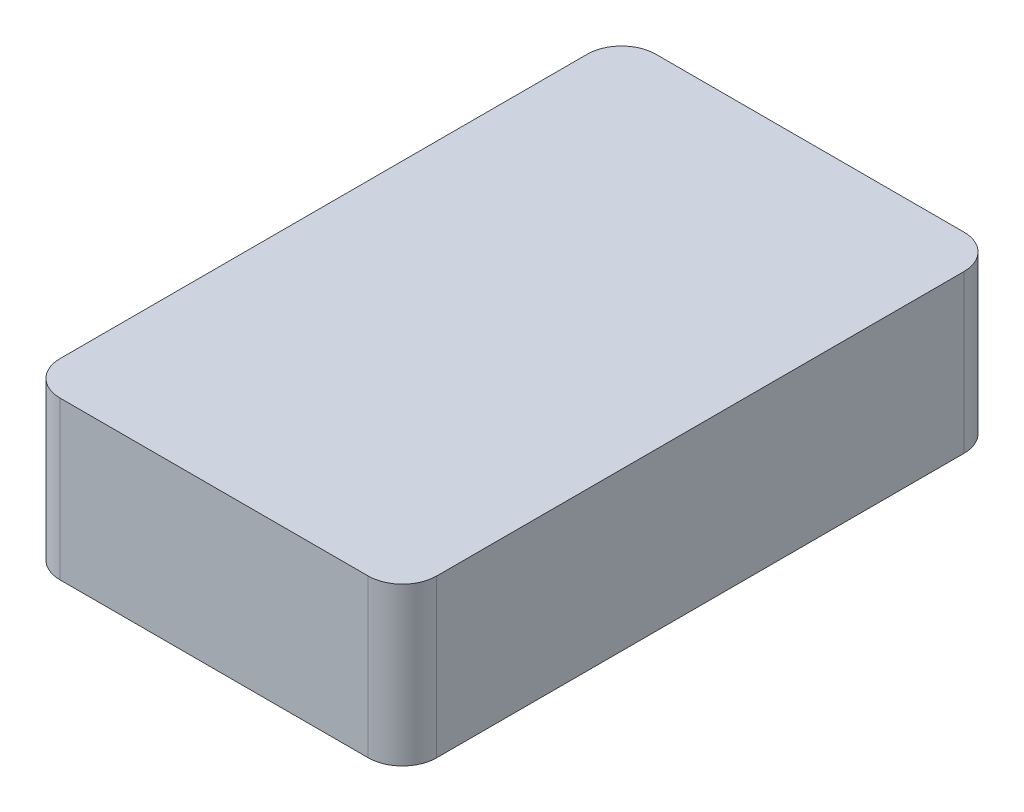
ISO-10303-21;
HEADER;
FILE_DESCRIPTION(('STEP AP214'),'2;1');
FILE_NAME('part.step','',(''),(''),'','','');
FILE_SCHEMA(('AUTOMOTIVE_DESIGN { 1 0 10303 214 1 1 1 1 }'));
ENDSEC;
DATA;
#1=APPLICATION_CONTEXT('core data for automotive mechanical design processes');
#2=APPLICATION_PROTOCOL_DEFINITION('international standard','automotive_design',2000,#1);
#3=PRODUCT_CONTEXT('',#1,'mechanical');
#4=PRODUCT('Part','Part','',(#3));
#5=PRODUCT_RELATED_PRODUCT_CATEGORY('part','',(#4));
#6=PRODUCT_DEFINITION_FORMATION('','',#4);
#7=PRODUCT_DEFINITION_CONTEXT('part definition',#1,'design');
#8=PRODUCT_DEFINITION('design','',#6,#7);
#9=PRODUCT_DEFINITION_SHAPE('','',#8);
#10=(LENGTH_UNIT() NAMED_UNIT(*) SI_UNIT(.MILLI.,.METRE.));
#11=(NAMED_UNIT(*) PLANE_ANGLE_UNIT() SI_UNIT($,.RADIAN.));
#12=(NAMED_UNIT(*) SI_UNIT($,.STERADIAN.) SOLID_ANGLE_UNIT());
#13=UNCERTAINTY_MEASURE_WITH_UNIT(LENGTH_MEASURE(1.E-05),#10,'distance_accuracy_value','');
#14=(GEOMETRIC_REPRESENTATION_CONTEXT(3) GLOBAL_UNCERTAINTY_ASSIGNED_CONTEXT((#13)) GLOBAL_UNIT_ASSIGNED_CONTEXT((#10,
#11,#12)) REPRESENTATION_CONTEXT('',''));
#15=CARTESIAN_POINT('',(0.,0.,0.));
#16=DIRECTION('',(0.,0.,1.));
#17=DIRECTION('',(1.,0.,0.));
#18=AXIS2_PLACEMENT_3D('',#15,#16,#17);
#19=CARTESIAN_POINT('',(-34.9399313153594,23.,20.7841209187291));
#20=DIRECTION('',(0.,-1.,0.));
#21=DIRECTION('',(0.,0.,-1.));
#22=AXIS2_PLACEMENT_3D('',#19,#20,#21);
#23=CYLINDRICAL_SURFACE('',#22,5.);
#24=CARTESIAN_POINT('',(-34.9399313153594,0.,20.7841209187291));
#25=DIRECTION('',(0.,1.,0.));
#26=DIRECTION('',(0.,0.,1.));
#27=AXIS2_PLACEMENT_3D('',#24,#25,#26);
#28=CIRCLE('',#27,5.);
#29=CARTESIAN_POINT('',(-39.9399313153594,0.,20.784120918729));
#30=VERTEX_POINT('',#29);
#31=CARTESIAN_POINT('',(-34.9399313153594,0.,25.7841209187291));
#32=VERTEX_POINT('',#31);
#33=EDGE_CURVE('E130',#30,#32,#28,.T.);
#34=ORIENTED_EDGE('',*,*,#33,.T.);
#35=DIRECTION('',(0.,-1.,0.));
#36=VECTOR('',#35,1.);
#37=CARTESIAN_POINT('',(-34.9399313153594,23.,25.7841209187291));
#38=LINE('',#37,#36);
#39=CARTESIAN_POINT('',(-34.9399313153594,23.,25.7841209187291));
#40=VERTEX_POINT('',#39);
#41=EDGE_CURVE('E11',#40,#32,#38,.T.);
#42=ORIENTED_EDGE('',*,*,#41,.F.);
#43=CARTESIAN_POINT('',(-34.9399313153594,23.,20.7841209187291));
#44=DIRECTION('',(0.,1.,0.));
#45=DIRECTION('',(0.,0.,1.));
#46=AXIS2_PLACEMENT_3D('',#43,#44,#45);
#47=CIRCLE('',#46,5.);
#48=CARTESIAN_POINT('',(-39.9399313153594,23.,20.784120918729));
#49=VERTEX_POINT('',#48);
#50=EDGE_CURVE('E144',#49,#40,#47,.T.);
#51=ORIENTED_EDGE('',*,*,#50,.F.);
#52=DIRECTION('',(0.,-1.,0.));
#53=VECTOR('',#52,1.);
#54=CARTESIAN_POINT('',(-39.9399313153594,23.,20.784120918729));
#55=LINE('',#54,#53);
#56=EDGE_CURVE('E126',#49,#30,#55,.T.);
#57=ORIENTED_EDGE('',*,*,#56,.T.);
#58=EDGE_LOOP('',(#34,#42,#51,#57));
#59=FACE_BOUND('',#58,.T.);
#60=ADVANCED_FACE('F34',(#59),#23,.T.);
#61=CARTESIAN_POINT('',(-34.9399313153594,23.,25.7841209187291));
#62=DIRECTION('',(0.,0.,-1.));
#63=DIRECTION('',(-1.,0.,0.));
#64=AXIS2_PLACEMENT_3D('',#61,#62,#63);
#65=PLANE('',#64);
#66=DIRECTION('',(1.,0.,0.));
#67=VECTOR('',#66,1.);
#68=CARTESIAN_POINT('',(-34.9399313153594,0.,25.7841209187291));
#69=LINE('',#68,#67);
#70=CARTESIAN_POINT('',(10.0600686846405,0.,25.7841209187291));
#71=VERTEX_POINT('',#70);
#72=EDGE_CURVE('E133',#32,#71,#69,.T.);
#73=ORIENTED_EDGE('',*,*,#72,.T.);
#74=DIRECTION('',(0.,-1.,0.));
#75=VECTOR('',#74,1.);
#76=CARTESIAN_POINT('',(10.0600686846405,23.,25.7841209187291));
#77=LINE('',#76,#75);
#78=CARTESIAN_POINT('',(10.0600686846405,23.,25.7841209187291));
#79=VERTEX_POINT('',#78);
#80=EDGE_CURVE('E42',#79,#71,#77,.T.);
#81=ORIENTED_EDGE('',*,*,#80,.F.);
#82=DIRECTION('',(1.,0.,0.));
#83=VECTOR('',#82,1.);
#84=CARTESIAN_POINT('',(-34.9399313153594,23.,25.7841209187291));
#85=LINE('',#84,#83);
#86=EDGE_CURVE('E93',#40,#79,#85,.T.);
#87=ORIENTED_EDGE('',*,*,#86,.F.);
#88=ORIENTED_EDGE('',*,*,#41,.T.);
#89=EDGE_LOOP('',(#73,#81,#87,#88));
#90=FACE_BOUND('',#89,.T.);
#91=ADVANCED_FACE('F179',(#90),#65,.F.);
#92=CARTESIAN_POINT('',(10.0600686846406,23.,20.7841209187291));
#93=DIRECTION('',(0.,-1.,0.));
#94=DIRECTION('',(0.,0.,-1.));
#95=AXIS2_PLACEMENT_3D('',#92,#93,#94);
#96=CYLINDRICAL_SURFACE('',#95,5.);
#97=CARTESIAN_POINT('',(10.0600686846406,0.,20.7841209187291));
#98=DIRECTION('',(0.,1.,0.));
#99=DIRECTION('',(0.,0.,1.));
#100=AXIS2_PLACEMENT_3D('',#97,#98,#99);
#101=CIRCLE('',#100,5.);
#102=CARTESIAN_POINT('',(15.0600686846406,0.,20.784120918729));
#103=VERTEX_POINT('',#102);
#104=EDGE_CURVE('E135',#71,#103,#101,.T.);
#105=ORIENTED_EDGE('',*,*,#104,.T.);
#106=DIRECTION('',(0.,-1.,0.));
#107=VECTOR('',#106,1.);
#108=CARTESIAN_POINT('',(15.0600686846406,23.,20.784120918729));
#109=LINE('',#108,#107);
#110=CARTESIAN_POINT('',(15.0600686846406,23.,20.784120918729));
#111=VERTEX_POINT('',#110);
#112=EDGE_CURVE('E151',#111,#103,#109,.T.);
#113=ORIENTED_EDGE('',*,*,#112,.F.);
#114=CARTESIAN_POINT('',(10.0600686846406,23.,20.7841209187291));
#115=DIRECTION('',(0.,1.,0.));
#116=DIRECTION('',(0.,0.,1.));
#117=AXIS2_PLACEMENT_3D('',#114,#115,#116);
#118=CIRCLE('',#117,5.);
#119=EDGE_CURVE('E159',#79,#111,#118,.T.);
#120=ORIENTED_EDGE('',*,*,#119,.F.);
#121=ORIENTED_EDGE('',*,*,#80,.T.);
#122=EDGE_LOOP('',(#105,#113,#120,#121));
#123=FACE_BOUND('',#122,.T.);
#124=ADVANCED_FACE('F157',(#123),#96,.T.);
#125=CARTESIAN_POINT('',(15.0600686846406,23.,20.784120918729));
#126=DIRECTION('',(-1.,0.,0.));
#127=DIRECTION('',(0.,0.,1.));
#128=AXIS2_PLACEMENT_3D('',#125,#126,#127);
#129=PLANE('',#128);
#130=DIRECTION('',(0.,0.,-1.));
#131=VECTOR('',#130,1.);
#132=CARTESIAN_POINT('',(15.0600686846406,0.,20.784120918729));
#133=LINE('',#132,#131);
#134=CARTESIAN_POINT('',(15.0600686846406,0.,-56.2158790812709));
#135=VERTEX_POINT('',#134);
#136=EDGE_CURVE('E137',#103,#135,#133,.T.);
#137=ORIENTED_EDGE('',*,*,#136,.T.);
#138=DIRECTION('',(0.,-1.,0.));
#139=VECTOR('',#138,1.);
#140=CARTESIAN_POINT('',(15.0600686846406,23.,-56.2158790812709));
#141=LINE('',#140,#139);
#142=CARTESIAN_POINT('',(15.0600686846406,23.,-56.2158790812709));
#143=VERTEX_POINT('',#142);
#144=EDGE_CURVE('E148',#143,#135,#141,.T.);
#145=ORIENTED_EDGE('',*,*,#144,.F.);
#146=DIRECTION('',(0.,0.,-1.));
#147=VECTOR('',#146,1.);
#148=CARTESIAN_POINT('',(15.0600686846406,23.,20.784120918729));
#149=LINE('',#148,#147);
#150=EDGE_CURVE('E171',#111,#143,#149,.T.);
#151=ORIENTED_EDGE('',*,*,#150,.F.);
#152=ORIENTED_EDGE('',*,*,#112,.T.);
#153=EDGE_LOOP('',(#137,#145,#151,#152));
#154=FACE_BOUND('',#153,.T.);
#155=ADVANCED_FACE('F167',(#154),#129,.F.);
#156=CARTESIAN_POINT('',(10.0600686846406,23.,-56.2158790812709));
#157=DIRECTION('',(0.,-1.,0.));
#158=DIRECTION('',(0.,0.,-1.));
#159=AXIS2_PLACEMENT_3D('',#156,#157,#158);
#160=CYLINDRICAL_SURFACE('',#159,5.);
#161=CARTESIAN_POINT('',(10.0600686846406,0.,-56.2158790812709));
#162=DIRECTION('',(0.,1.,0.));
#163=DIRECTION('',(0.,0.,-1.));
#164=AXIS2_PLACEMENT_3D('',#161,#162,#163);
#165=CIRCLE('',#164,5.);
#166=CARTESIAN_POINT('',(10.0600686846405,0.,-61.2158790812709));
#167=VERTEX_POINT('',#166);
#168=EDGE_CURVE('E139',#135,#167,#165,.T.);
#169=ORIENTED_EDGE('',*,*,#168,.T.);
#170=DIRECTION('',(0.,-1.,0.));
#171=VECTOR('',#170,1.);
#172=CARTESIAN_POINT('',(10.0600686846405,23.,-61.2158790812709));
#173=LINE('',#172,#171);
#174=CARTESIAN_POINT('',(10.0600686846405,23.,-61.2158790812709));
#175=VERTEX_POINT('',#174);
#176=EDGE_CURVE('E121',#175,#167,#173,.T.);
#177=ORIENTED_EDGE('',*,*,#176,.F.);
#178=CARTESIAN_POINT('',(10.0600686846406,23.,-56.2158790812709));
#179=DIRECTION('',(0.,1.,0.));
#180=DIRECTION('',(0.,0.,-1.));
#181=AXIS2_PLACEMENT_3D('',#178,#179,#180);
#182=CIRCLE('',#181,5.);
#183=EDGE_CURVE('E112',#143,#175,#182,.T.);
#184=ORIENTED_EDGE('',*,*,#183,.F.);
#185=ORIENTED_EDGE('',*,*,#144,.T.);
#186=EDGE_LOOP('',(#169,#177,#184,#185));
#187=FACE_BOUND('',#186,.T.);
#188=ADVANCED_FACE('F170',(#187),#160,.T.);
#189=CARTESIAN_POINT('',(-34.9399313153594,23.,-61.2158790812709));
#190=DIRECTION('',(0.,0.,1.));
#191=DIRECTION('',(1.,0.,0.));
#192=AXIS2_PLACEMENT_3D('',#189,#190,#191);
#193=PLANE('',#192);
#194=DIRECTION('',(-1.,0.,0.));
#195=VECTOR('',#194,1.);
#196=CARTESIAN_POINT('',(-34.9399313153594,0.,-61.2158790812709));
#197=LINE('',#196,#195);
#198=CARTESIAN_POINT('',(-34.9399313153594,0.,-61.2158790812709));
#199=VERTEX_POINT('',#198);
#200=EDGE_CURVE('E120',#167,#199,#197,.T.);
#201=ORIENTED_EDGE('',*,*,#200,.T.);
#202=DIRECTION('',(0.,-1.,0.));
#203=VECTOR('',#202,1.);
#204=CARTESIAN_POINT('',(-34.9399313153594,23.,-61.2158790812709));
#205=LINE('',#204,#203);
#206=CARTESIAN_POINT('',(-34.9399313153594,23.,-61.2158790812709));
#207=VERTEX_POINT('',#206);
#208=EDGE_CURVE('E117',#207,#199,#205,.T.);
#209=ORIENTED_EDGE('',*,*,#208,.F.);
#210=DIRECTION('',(-1.,0.,0.));
#211=VECTOR('',#210,1.);
#212=CARTESIAN_POINT('',(-34.9399313153594,23.,-61.2158790812709));
#213=LINE('',#212,#211);
#214=EDGE_CURVE('E106',#175,#207,#213,.T.);
#215=ORIENTED_EDGE('',*,*,#214,.F.);
#216=ORIENTED_EDGE('',*,*,#176,.T.);
#217=EDGE_LOOP('',(#201,#209,#215,#216));
#218=FACE_BOUND('',#217,.T.);
#219=ADVANCED_FACE('F118',(#218),#193,.F.);
#220=CARTESIAN_POINT('',(-34.9399313153594,23.,-56.2158790812709));
#221=DIRECTION('',(0.,-1.,0.));
#222=DIRECTION('',(0.,0.,-1.));
#223=AXIS2_PLACEMENT_3D('',#220,#221,#222);
#224=CYLINDRICAL_SURFACE('',#223,5.);
#225=CARTESIAN_POINT('',(-34.9399313153594,0.,-56.2158790812709));
#226=DIRECTION('',(0.,1.,0.));
#227=DIRECTION('',(0.,0.,-1.));
#228=AXIS2_PLACEMENT_3D('',#225,#226,#227);
#229=CIRCLE('',#228,5.);
#230=CARTESIAN_POINT('',(-39.9399313153594,0.,-56.2158790812709));
#231=VERTEX_POINT('',#230);
#232=EDGE_CURVE('E79',#199,#231,#229,.T.);
#233=ORIENTED_EDGE('',*,*,#232,.T.);
#234=DIRECTION('',(0.,-1.,0.));
#235=VECTOR('',#234,1.);
#236=CARTESIAN_POINT('',(-39.9399313153594,23.,-56.2158790812709));
#237=LINE('',#236,#235);
#238=CARTESIAN_POINT('',(-39.9399313153594,23.,-56.2158790812709));
#239=VERTEX_POINT('',#238);
#240=EDGE_CURVE('E122',#239,#231,#237,.T.);
#241=ORIENTED_EDGE('',*,*,#240,.F.);
#242=CARTESIAN_POINT('',(-34.9399313153594,23.,-56.2158790812709));
#243=DIRECTION('',(0.,1.,0.));
#244=DIRECTION('',(0.,0.,-1.));
#245=AXIS2_PLACEMENT_3D('',#242,#243,#244);
#246=CIRCLE('',#245,5.);
#247=EDGE_CURVE('E110',#207,#239,#246,.T.);
#248=ORIENTED_EDGE('',*,*,#247,.F.);
#249=ORIENTED_EDGE('',*,*,#208,.T.);
#250=EDGE_LOOP('',(#233,#241,#248,#249));
#251=FACE_BOUND('',#250,.T.);
#252=ADVANCED_FACE('F124',(#251),#224,.T.);
#253=CARTESIAN_POINT('',(-39.9399313153594,23.,20.784120918729));
#254=DIRECTION('',(1.,0.,0.));
#255=DIRECTION('',(0.,0.,-1.));
#256=AXIS2_PLACEMENT_3D('',#253,#254,#255);
#257=PLANE('',#256);
#258=DIRECTION('',(0.,0.,1.));
#259=VECTOR('',#258,1.);
#260=CARTESIAN_POINT('',(-39.9399313153594,0.,20.784120918729));
#261=LINE('',#260,#259);
#262=EDGE_CURVE('E85',#231,#30,#261,.T.);
#263=ORIENTED_EDGE('',*,*,#262,.T.);
#264=ORIENTED_EDGE('',*,*,#56,.F.);
#265=DIRECTION('',(0.,0.,1.));
#266=VECTOR('',#265,1.);
#267=CARTESIAN_POINT('',(-39.9399313153594,23.,20.784120918729));
#268=LINE('',#267,#266);
#269=EDGE_CURVE('E50',#239,#49,#268,.T.);
#270=ORIENTED_EDGE('',*,*,#269,.F.);
#271=ORIENTED_EDGE('',*,*,#240,.T.);
#272=EDGE_LOOP('',(#263,#264,#270,#271));
#273=FACE_BOUND('',#272,.T.);
#274=ADVANCED_FACE('F195',(#273),#257,.F.);
#275=CARTESIAN_POINT('',(-34.9399313153594,23.,20.7841209187291));
#276=DIRECTION('',(0.,1.,0.));
#277=DIRECTION('',(0.,0.,1.));
#278=AXIS2_PLACEMENT_3D('',#275,#276,#277);
#279=PLANE('',#278);
#280=ORIENTED_EDGE('',*,*,#50,.T.);
#281=ORIENTED_EDGE('',*,*,#86,.T.);
#282=ORIENTED_EDGE('',*,*,#119,.T.);
#283=ORIENTED_EDGE('',*,*,#150,.T.);
#284=ORIENTED_EDGE('',*,*,#183,.T.);
#285=ORIENTED_EDGE('',*,*,#214,.T.);
#286=ORIENTED_EDGE('',*,*,#247,.T.);
#287=ORIENTED_EDGE('',*,*,#269,.T.);
#288=EDGE_LOOP('',(#280,#281,#282,#283,#284,#285,#286,#287));
#289=FACE_BOUND('',#288,.T.);
#290=ADVANCED_FACE('F108',(#289),#279,.T.);
#291=CARTESIAN_POINT('',(-34.9399313153594,0.,20.7841209187291));
#292=DIRECTION('',(0.,1.,0.));
#293=DIRECTION('',(0.,0.,1.));
#294=AXIS2_PLACEMENT_3D('',#291,#292,#293);
#295=PLANE('',#294);
#296=ORIENTED_EDGE('',*,*,#33,.F.);
#297=ORIENTED_EDGE('',*,*,#262,.F.);
#298=ORIENTED_EDGE('',*,*,#232,.F.);
#299=ORIENTED_EDGE('',*,*,#200,.F.);
#300=ORIENTED_EDGE('',*,*,#168,.F.);
#301=ORIENTED_EDGE('',*,*,#136,.F.);
#302=ORIENTED_EDGE('',*,*,#104,.F.);
#303=ORIENTED_EDGE('',*,*,#72,.F.);
#304=EDGE_LOOP('',(#296,#297,#298,#299,#300,#301,#302,#303));
#305=FACE_BOUND('',#304,.T.);
#306=ADVANCED_FACE('F163',(#305),#295,.F.);
#307=CLOSED_SHELL('',(#60,#91,#124,#155,#188,#219,#252,#274,#290,#306));
#308=MANIFOLD_SOLID_BREP('B2',#307);
#309=ADVANCED_BREP_SHAPE_REPRESENTATION('',(#18,#308),#14);
#310=SHAPE_DEFINITION_REPRESENTATION(#9,#309);
ENDSEC;
END-ISO-10303-21;
